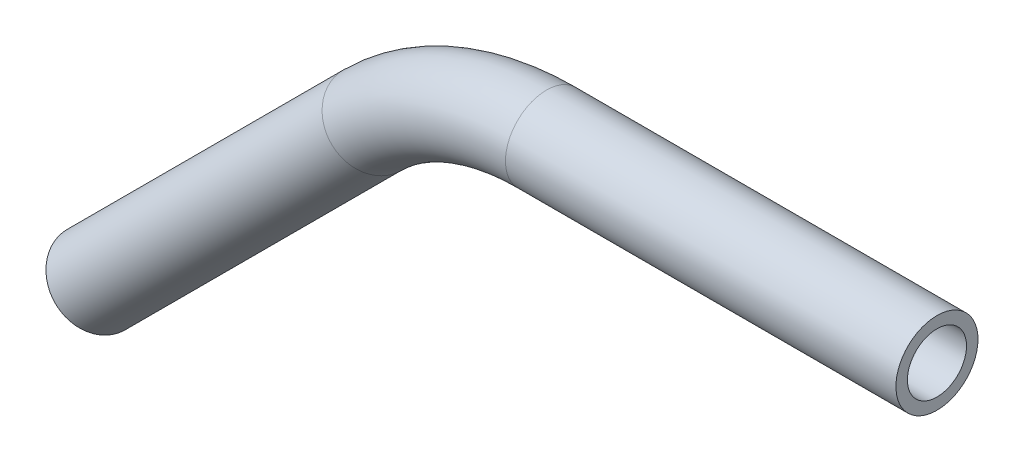
ISO-10303-21;
HEADER;
FILE_DESCRIPTION(('STEP AP214'),'2;1');
FILE_NAME('part.step','',(''),(''),'','','');
FILE_SCHEMA(('AUTOMOTIVE_DESIGN { 1 0 10303 214 1 1 1 1 }'));
ENDSEC;
DATA;
#1=APPLICATION_CONTEXT('core data for automotive mechanical design processes');
#2=APPLICATION_PROTOCOL_DEFINITION('international standard','automotive_design',2000,#1);
#3=PRODUCT_CONTEXT('',#1,'mechanical');
#4=PRODUCT('Part','Part','',(#3));
#5=PRODUCT_RELATED_PRODUCT_CATEGORY('part','',(#4));
#6=PRODUCT_DEFINITION_FORMATION('','',#4);
#7=PRODUCT_DEFINITION_CONTEXT('part definition',#1,'design');
#8=PRODUCT_DEFINITION('design','',#6,#7);
#9=PRODUCT_DEFINITION_SHAPE('','',#8);
#10=(LENGTH_UNIT() NAMED_UNIT(*) SI_UNIT(.MILLI.,.METRE.));
#11=(NAMED_UNIT(*) PLANE_ANGLE_UNIT() SI_UNIT($,.RADIAN.));
#12=(NAMED_UNIT(*) SI_UNIT($,.STERADIAN.) SOLID_ANGLE_UNIT());
#13=UNCERTAINTY_MEASURE_WITH_UNIT(LENGTH_MEASURE(1.E-05),#10,'distance_accuracy_value','');
#14=(GEOMETRIC_REPRESENTATION_CONTEXT(3) GLOBAL_UNCERTAINTY_ASSIGNED_CONTEXT((#13)) GLOBAL_UNIT_ASSIGNED_CONTEXT((#10,
#11,#12)) REPRESENTATION_CONTEXT('',''));
#15=CARTESIAN_POINT('',(0.,0.,0.));
#16=DIRECTION('',(0.,0.,1.));
#17=DIRECTION('',(1.,0.,0.));
#18=AXIS2_PLACEMENT_3D('',#15,#16,#17);
#19=CARTESIAN_POINT('',(-22.4375938414419,-22.437593841442,0.));
#20=DIRECTION('',(0.707106781186547,0.707106781186549,0.));
#21=DIRECTION('',(-0.707106781186549,0.707106781186547,0.));
#22=AXIS2_PLACEMENT_3D('',#19,#20,#21);
#23=CYLINDRICAL_SURFACE('',#22,3.175);
#24=CARTESIAN_POINT('',(-1.07644129663079,-1.0764412966308,0.));
#25=DIRECTION('',(0.707106781186547,0.707106781186549,0.));
#26=DIRECTION('',(0.,0.,-1.));
#27=AXIS2_PLACEMENT_3D('',#24,#25,#26);
#28=CIRCLE('',#27,3.175);
#29=CARTESIAN_POINT('',(-3.32150532689809,1.16862273363648,0.));
#30=VERTEX_POINT('',#29);
#31=EDGE_CURVE('E78',#30,#30,#28,.T.);
#32=ORIENTED_EDGE('',*,*,#31,.F.);
#33=EDGE_LOOP('',(#32));
#34=FACE_BOUND('',#33,.T.);
#35=CARTESIAN_POINT('',(-22.4375938414419,-22.437593841442,0.));
#36=DIRECTION('',(0.707106781186547,0.707106781186549,0.));
#37=DIRECTION('',(0.,0.,-1.));
#38=AXIS2_PLACEMENT_3D('',#35,#36,#37);
#39=CIRCLE('',#38,3.175);
#40=CARTESIAN_POINT('',(-22.4375938414419,-22.437593841442,-3.175));
#41=VERTEX_POINT('',#40);
#42=EDGE_CURVE('E47',#41,#41,#39,.T.);
#43=ORIENTED_EDGE('',*,*,#42,.T.);
#44=EDGE_LOOP('',(#43));
#45=FACE_BOUND('',#44,.T.);
#46=ADVANCED_FACE('F32',(#34,#45),#23,.T.);
#47=CARTESIAN_POINT('',(12.393942884973,-14.5468254782345,0.));
#48=DIRECTION('',(0.,0.,-1.));
#49=DIRECTION('',(-1.,0.,0.));
#50=AXIS2_PLACEMENT_3D('',#47,#48,#49);
#51=TOROIDAL_SURFACE('',#50,19.05,3.175);
#52=CARTESIAN_POINT('',(12.393942884973,4.50317452176552,0.));
#53=DIRECTION('',(1.,0.,0.));
#54=DIRECTION('',(0.,0.,-1.));
#55=AXIS2_PLACEMENT_3D('',#52,#53,#54);
#56=CIRCLE('',#55,3.175);
#57=CARTESIAN_POINT('',(12.393942884973,7.6781745217655,0.));
#58=VERTEX_POINT('',#57);
#59=EDGE_CURVE('E36',#58,#58,#56,.T.);
#60=CARTESIAN_POINT('',(12.393942884973,-14.5468254782345,0.));
#61=DIRECTION('',(0.,0.,-1.));
#62=DIRECTION('',(-1.,0.,0.));
#63=AXIS2_PLACEMENT_3D('',#60,#61,#62);
#64=CIRCLE('',#63,22.225);
#65=EDGE_CURVE('',#30,#58,#64,.T.);
#66=ORIENTED_EDGE('',*,*,#31,.T.);
#67=ORIENTED_EDGE('',*,*,#59,.F.);
#68=ORIENTED_EDGE('',*,*,#65,.T.);
#69=ORIENTED_EDGE('',*,*,#65,.F.);
#70=EDGE_LOOP('',(#66,#68,#67,#69));
#71=FACE_BOUND('',#70,.T.);
#72=ADVANCED_FACE('F86',(#71),#51,.T.);
#73=CARTESIAN_POINT('',(12.393942884973,4.50317452176551,0.));
#74=DIRECTION('',(1.,0.,0.));
#75=DIRECTION('',(0.,1.,0.));
#76=AXIS2_PLACEMENT_3D('',#73,#74,#75);
#77=CYLINDRICAL_SURFACE('',#76,3.175);
#78=CARTESIAN_POINT('',(42.6031745217655,4.50317452176551,0.));
#79=DIRECTION('',(1.,0.,0.));
#80=DIRECTION('',(0.,0.,-1.));
#81=AXIS2_PLACEMENT_3D('',#78,#79,#80);
#82=CIRCLE('',#81,3.175);
#83=CARTESIAN_POINT('',(42.6031745217655,4.50317452176551,-3.175));
#84=VERTEX_POINT('',#83);
#85=EDGE_CURVE('E52',#84,#84,#82,.T.);
#86=ORIENTED_EDGE('',*,*,#85,.F.);
#87=EDGE_LOOP('',(#86));
#88=FACE_BOUND('',#87,.T.);
#89=ORIENTED_EDGE('',*,*,#59,.T.);
#90=EDGE_LOOP('',(#89));
#91=FACE_BOUND('',#90,.T.);
#92=ADVANCED_FACE('F34',(#88,#91),#77,.T.);
#93=CARTESIAN_POINT('',(-22.4375938414419,-22.437593841442,0.));
#94=DIRECTION('',(0.707106781186547,0.707106781186549,0.));
#95=DIRECTION('',(0.,0.,-1.));
#96=AXIS2_PLACEMENT_3D('',#93,#94,#95);
#97=PLANE('',#96);
#98=CARTESIAN_POINT('',(-22.4375938414419,-22.437593841442,0.));
#99=DIRECTION('',(0.707106781186547,0.707106781186549,0.));
#100=DIRECTION('',(0.,0.,-1.));
#101=AXIS2_PLACEMENT_3D('',#98,#99,#100);
#102=CIRCLE('',#101,2.286);
#103=CARTESIAN_POINT('',(-22.4375938414419,-22.437593841442,-2.286));
#104=VERTEX_POINT('',#103);
#105=EDGE_CURVE('E73',#104,#104,#102,.F.);
#106=ORIENTED_EDGE('',*,*,#105,.F.);
#107=EDGE_LOOP('',(#106));
#108=FACE_BOUND('',#107,.T.);
#109=ORIENTED_EDGE('',*,*,#42,.F.);
#110=EDGE_LOOP('',(#109));
#111=FACE_BOUND('',#110,.T.);
#112=ADVANCED_FACE('F92',(#108,#111),#97,.F.);
#113=CARTESIAN_POINT('',(42.6031745217655,4.50317452176551,0.));
#114=DIRECTION('',(1.,0.,0.));
#115=DIRECTION('',(0.,0.,-1.));
#116=AXIS2_PLACEMENT_3D('',#113,#114,#115);
#117=PLANE('',#116);
#118=CARTESIAN_POINT('',(42.6031745217655,4.50317452176551,0.));
#119=DIRECTION('',(1.,0.,0.));
#120=DIRECTION('',(0.,0.,-1.));
#121=AXIS2_PLACEMENT_3D('',#118,#119,#120);
#122=CIRCLE('',#121,2.286);
#123=CARTESIAN_POINT('',(42.6031745217655,4.50317452176551,-2.286));
#124=VERTEX_POINT('',#123);
#125=EDGE_CURVE('E11',#124,#124,#122,.F.);
#126=ORIENTED_EDGE('',*,*,#125,.T.);
#127=EDGE_LOOP('',(#126));
#128=FACE_BOUND('',#127,.T.);
#129=ORIENTED_EDGE('',*,*,#85,.T.);
#130=EDGE_LOOP('',(#129));
#131=FACE_BOUND('',#130,.T.);
#132=ADVANCED_FACE('F59',(#128,#131),#117,.T.);
#133=CARTESIAN_POINT('',(-22.4375938414419,-22.437593841442,0.));
#134=DIRECTION('',(0.707106781186547,0.707106781186549,0.));
#135=DIRECTION('',(-0.707106781186549,0.707106781186547,0.));
#136=AXIS2_PLACEMENT_3D('',#133,#134,#135);
#137=CYLINDRICAL_SURFACE('',#136,2.286);
#138=CARTESIAN_POINT('',(-1.07644129663079,-1.0764412966308,0.));
#139=DIRECTION('',(0.707106781186547,0.707106781186549,0.));
#140=DIRECTION('',(0.,0.,-1.));
#141=AXIS2_PLACEMENT_3D('',#138,#139,#140);
#142=CIRCLE('',#141,2.286);
#143=CARTESIAN_POINT('',(-2.69288739842325,0.540004805161646,0.));
#144=VERTEX_POINT('',#143);
#145=EDGE_CURVE('E70',#144,#144,#142,.F.);
#146=ORIENTED_EDGE('',*,*,#145,.F.);
#147=EDGE_LOOP('',(#146));
#148=FACE_BOUND('',#147,.T.);
#149=ORIENTED_EDGE('',*,*,#105,.T.);
#150=EDGE_LOOP('',(#149));
#151=FACE_BOUND('',#150,.T.);
#152=ADVANCED_FACE('F100',(#148,#151),#137,.F.);
#153=CARTESIAN_POINT('',(12.393942884973,-14.5468254782345,0.));
#154=DIRECTION('',(0.,0.,-1.));
#155=DIRECTION('',(-1.,0.,0.));
#156=AXIS2_PLACEMENT_3D('',#153,#154,#155);
#157=TOROIDAL_SURFACE('',#156,19.05,2.286);
#158=CARTESIAN_POINT('',(12.393942884973,4.50317452176552,0.));
#159=DIRECTION('',(1.,0.,0.));
#160=DIRECTION('',(0.,0.,-1.));
#161=AXIS2_PLACEMENT_3D('',#158,#159,#160);
#162=CIRCLE('',#161,2.286);
#163=CARTESIAN_POINT('',(12.393942884973,6.7891745217655,0.));
#164=VERTEX_POINT('',#163);
#165=EDGE_CURVE('E41',#164,#164,#162,.F.);
#166=CARTESIAN_POINT('',(12.393942884973,-14.5468254782345,0.));
#167=DIRECTION('',(0.,0.,-1.));
#168=DIRECTION('',(-1.,0.,0.));
#169=AXIS2_PLACEMENT_3D('',#166,#167,#168);
#170=CIRCLE('',#169,21.336);
#171=EDGE_CURVE('',#144,#164,#170,.T.);
#172=ORIENTED_EDGE('',*,*,#145,.T.);
#173=ORIENTED_EDGE('',*,*,#165,.F.);
#174=ORIENTED_EDGE('',*,*,#171,.T.);
#175=ORIENTED_EDGE('',*,*,#171,.F.);
#176=EDGE_LOOP('',(#172,#174,#173,#175));
#177=FACE_BOUND('',#176,.T.);
#178=ADVANCED_FACE('F65',(#177),#157,.F.);
#179=CARTESIAN_POINT('',(12.393942884973,4.50317452176551,0.));
#180=DIRECTION('',(1.,0.,0.));
#181=DIRECTION('',(0.,1.,0.));
#182=AXIS2_PLACEMENT_3D('',#179,#180,#181);
#183=CYLINDRICAL_SURFACE('',#182,2.286);
#184=ORIENTED_EDGE('',*,*,#125,.F.);
#185=EDGE_LOOP('',(#184));
#186=FACE_BOUND('',#185,.T.);
#187=ORIENTED_EDGE('',*,*,#165,.T.);
#188=EDGE_LOOP('',(#187));
#189=FACE_BOUND('',#188,.T.);
#190=ADVANCED_FACE('F62',(#186,#189),#183,.F.);
#191=CLOSED_SHELL('',(#46,#72,#92,#112,#132,#152,#178,#190));
#192=MANIFOLD_SOLID_BREP('B2',#191);
#193=ADVANCED_BREP_SHAPE_REPRESENTATION('',(#18,#192),#14);
#194=SHAPE_DEFINITION_REPRESENTATION(#9,#193);
ENDSEC;
END-ISO-10303-21;
